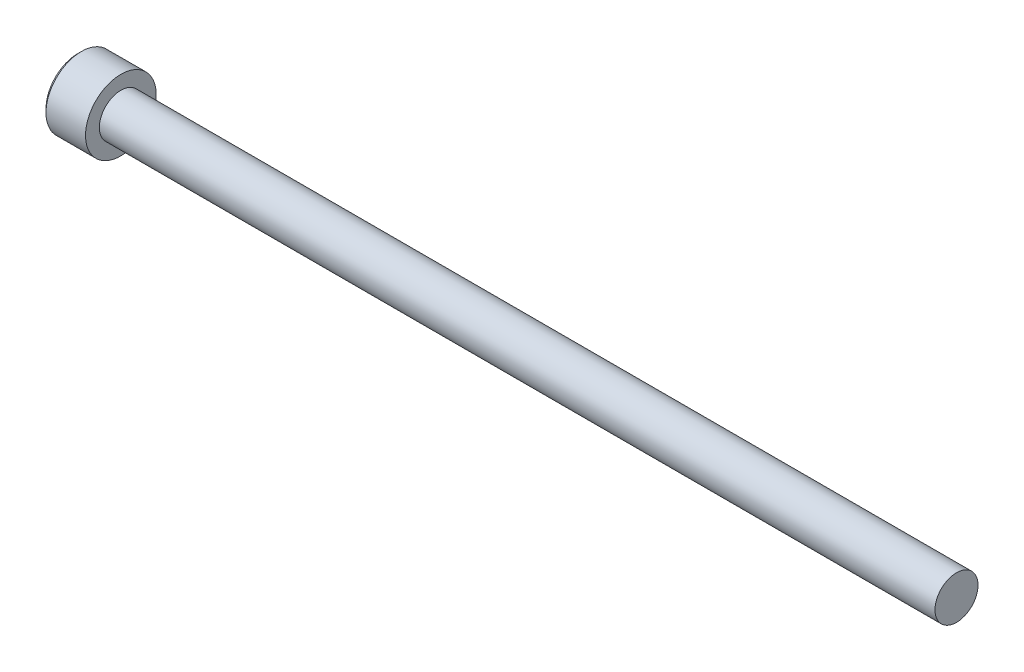
ISO-10303-21;
HEADER;
FILE_DESCRIPTION(('STEP AP214'),'2;1');
FILE_NAME('part.step','',(''),(''),'','','');
FILE_SCHEMA(('AUTOMOTIVE_DESIGN { 1 0 10303 214 1 1 1 1 }'));
ENDSEC;
DATA;
#1=APPLICATION_CONTEXT('core data for automotive mechanical design processes');
#2=APPLICATION_PROTOCOL_DEFINITION('international standard','automotive_design',2000,#1);
#3=PRODUCT_CONTEXT('',#1,'mechanical');
#4=PRODUCT('Part','Part','',(#3));
#5=PRODUCT_RELATED_PRODUCT_CATEGORY('part','',(#4));
#6=PRODUCT_DEFINITION_FORMATION('','',#4);
#7=PRODUCT_DEFINITION_CONTEXT('part definition',#1,'design');
#8=PRODUCT_DEFINITION('design','',#6,#7);
#9=PRODUCT_DEFINITION_SHAPE('','',#8);
#10=(LENGTH_UNIT() NAMED_UNIT(*) SI_UNIT(.MILLI.,.METRE.));
#11=(NAMED_UNIT(*) PLANE_ANGLE_UNIT() SI_UNIT($,.RADIAN.));
#12=(NAMED_UNIT(*) SI_UNIT($,.STERADIAN.) SOLID_ANGLE_UNIT());
#13=UNCERTAINTY_MEASURE_WITH_UNIT(LENGTH_MEASURE(1.E-05),#10,'distance_accuracy_value','');
#14=(GEOMETRIC_REPRESENTATION_CONTEXT(3) GLOBAL_UNCERTAINTY_ASSIGNED_CONTEXT((#13)) GLOBAL_UNIT_ASSIGNED_CONTEXT((#10,
#11,#12)) REPRESENTATION_CONTEXT('',''));
#15=CARTESIAN_POINT('',(0.,0.,0.));
#16=DIRECTION('',(0.,0.,1.));
#17=DIRECTION('',(1.,0.,0.));
#18=AXIS2_PLACEMENT_3D('',#15,#16,#17);
#19=CARTESIAN_POINT('',(-2.28600000000007,-1.14567944042317,1.984375));
#20=DIRECTION('',(0.,0.,1.));
#21=DIRECTION('',(1.,0.,0.));
#22=AXIS2_PLACEMENT_3D('',#19,#20,#21);
#23=PLANE('',#22);
#24=CARTESIAN_POINT('',(-4.82599999995852,1.14567944044653,1.98437499999554));
#25=CARTESIAN_POINT('',(-4.78691618362732,1.06743880343266,1.9843749999984));
#26=CARTESIAN_POINT('',(-4.75011447684892,0.987898318960917,1.98437499999957));
#27=CARTESIAN_POINT('',(-4.68265620500518,0.825677042028778,1.98437500000043));
#28=CARTESIAN_POINT('',(-4.65204056061138,0.742979382529199,1.98437500000012));
#29=CARTESIAN_POINT('',(-4.5991739228306,0.575193959555969,1.98437499999988));
#30=CARTESIAN_POINT('',(-4.57689462080725,0.490115359117279,1.98437499999997));
#31=CARTESIAN_POINT('',(-4.54259467221837,0.318093091130193,1.98437500000003));
#32=CARTESIAN_POINT('',(-4.5305423022885,0.231156054976726,1.984375));
#33=CARTESIAN_POINT('',(-4.52249110263747,0.119918521511051,1.984375));
#34=CARTESIAN_POINT('',(-4.52118947557477,0.0959468443046798,1.984375));
#35=CARTESIAN_POINT('',(-4.51945182629813,0.0479845644411998,1.984375));
#36=CARTESIAN_POINT('',(-4.51901533386223,0.0239939791589393,1.984375));
#37=CARTESIAN_POINT('',(-4.51901809008399,-0.0602201717457363,1.984375));
#38=CARTESIAN_POINT('',(-4.52177452299902,-0.120461721905447,1.984375));
#39=CARTESIAN_POINT('',(-4.5326365512493,-0.240474970989197,1.984375));
#40=CARTESIAN_POINT('',(-4.54074587749718,-0.300246312758427,1.984375));
#41=CARTESIAN_POINT('',(-4.57259622946939,-0.478763752804282,1.984375));
#42=CARTESIAN_POINT('',(-4.60385422611702,-0.596208828937734,1.984375));
#43=CARTESIAN_POINT('',(-4.66780003592237,-0.785921487441256,1.984375));
#44=CARTESIAN_POINT('',(-4.69623457768558,-0.859734609866899,1.984375));
#45=CARTESIAN_POINT('',(-4.75786140400812,-1.00456595519282,1.984375));
#46=CARTESIAN_POINT('',(-4.79100779300359,-1.07560356657101,1.984375));
#47=CARTESIAN_POINT('',(-4.82599999995643,-1.14567944044724,1.984375));
#48=B_SPLINE_CURVE_WITH_KNOTS('',3,(#24,#25,#26,#27,#28,#29,#30,#31,#32,#33,#34,#35,#36,#37,#38,
#39,#40,#41,#42,#43,#44,#45,#46,#47),.UNSPECIFIED.,.F.,.F.,(4,2,2,2,2,2,2,2,2,2,2,4),(0.,
0.262559005207405,0.526801735838036,0.790138824405318,1.05265603861765,1.12466619182083,
1.19663719499031,1.3772702672652,1.55802937209382,1.92104085090328,2.15819130092264,
2.39317265078575),.UNSPECIFIED.);
#49=CARTESIAN_POINT('',(-4.82599999996829,1.14567944041753,1.98437500003084));
#50=VERTEX_POINT('',#49);
#51=CARTESIAN_POINT('',(-4.8259999999622,-1.14567944043207,1.98437500001542));
#52=VERTEX_POINT('',#51);
#53=EDGE_CURVE('E20',#50,#52,#48,.T.);
#54=ORIENTED_EDGE('',*,*,#53,.F.);
#55=DIRECTION('',(1.,0.,0.));
#56=VECTOR('',#55,1.);
#57=CARTESIAN_POINT('',(-2.28600000000007,1.14567944042316,1.984375));
#58=LINE('',#57,#56);
#59=CARTESIAN_POINT('',(-2.28600000000007,1.14567944042316,1.984375));
#60=VERTEX_POINT('',#59);
#61=EDGE_CURVE('E68',#50,#60,#58,.T.);
#62=ORIENTED_EDGE('',*,*,#61,.T.);
#63=DIRECTION('',(0.,1.,0.));
#64=VECTOR('',#63,1.);
#65=CARTESIAN_POINT('',(-2.28600000000007,0.,1.984375));
#66=LINE('',#65,#64);
#67=CARTESIAN_POINT('',(-2.28600000000007,-1.14567944042317,1.984375));
#68=VERTEX_POINT('',#67);
#69=EDGE_CURVE('E74',#68,#60,#66,.T.);
#70=ORIENTED_EDGE('',*,*,#69,.F.);
#71=DIRECTION('',(1.,0.,0.));
#72=VECTOR('',#71,1.);
#73=CARTESIAN_POINT('',(-2.28600000000007,-1.14567944042317,1.984375));
#74=LINE('',#73,#72);
#75=EDGE_CURVE('E71',#68,#52,#74,.F.);
#76=ORIENTED_EDGE('',*,*,#75,.T.);
#77=EDGE_LOOP('',(#54,#62,#70,#76));
#78=FACE_BOUND('',#77,.T.);
#79=ADVANCED_FACE('F16',(#78),#23,.F.);
#80=CARTESIAN_POINT('',(-2.28600000000007,0.,0.));
#81=DIRECTION('',(-1.,0.,0.));
#82=DIRECTION('',(0.,0.,1.));
#83=AXIS2_PLACEMENT_3D('',#80,#81,#82);
#84=PLANE('',#83);
#85=DIRECTION('',(0.,0.5,0.866025403784439));
#86=VECTOR('',#85,1.);
#87=CARTESIAN_POINT('',(-2.28600000000007,2.29135888084633,0.));
#88=LINE('',#87,#86);
#89=CARTESIAN_POINT('',(-2.28600000000007,2.29135888084633,0.));
#90=VERTEX_POINT('',#89);
#91=CARTESIAN_POINT('',(-2.28600000000007,1.14567944042316,-1.984375));
#92=VERTEX_POINT('',#91);
#93=EDGE_CURVE('E82',#90,#92,#88,.F.);
#94=ORIENTED_EDGE('',*,*,#93,.T.);
#95=DIRECTION('',(0.,1.,0.));
#96=VECTOR('',#95,1.);
#97=CARTESIAN_POINT('',(-2.28600000000007,1.14567944042316,-1.984375));
#98=LINE('',#97,#96);
#99=CARTESIAN_POINT('',(-2.28600000000007,-1.14567944042316,-1.984375));
#100=VERTEX_POINT('',#99);
#101=EDGE_CURVE('E242',#92,#100,#98,.F.);
#102=ORIENTED_EDGE('',*,*,#101,.T.);
#103=DIRECTION('',(0.,0.5,-0.866025403784439));
#104=VECTOR('',#103,1.);
#105=CARTESIAN_POINT('',(-2.28600000000007,-1.14567944042316,-1.984375));
#106=LINE('',#105,#104);
#107=CARTESIAN_POINT('',(-2.28600000000007,-2.29135888084633,0.));
#108=VERTEX_POINT('',#107);
#109=EDGE_CURVE('E227',#100,#108,#106,.F.);
#110=ORIENTED_EDGE('',*,*,#109,.T.);
#111=DIRECTION('',(0.,-0.5,-0.866025403784439));
#112=VECTOR('',#111,1.);
#113=CARTESIAN_POINT('',(-2.28600000000007,-2.29135888084633,0.));
#114=LINE('',#113,#112);
#115=EDGE_CURVE('E224',#108,#68,#114,.F.);
#116=ORIENTED_EDGE('',*,*,#115,.T.);
#117=ORIENTED_EDGE('',*,*,#69,.T.);
#118=DIRECTION('',(0.,-0.5,0.866025403784439));
#119=VECTOR('',#118,1.);
#120=CARTESIAN_POINT('',(-2.28600000000007,1.14567944042316,1.984375));
#121=LINE('',#120,#119);
#122=EDGE_CURVE('E81',#60,#90,#121,.F.);
#123=ORIENTED_EDGE('',*,*,#122,.T.);
#124=EDGE_LOOP('',(#94,#102,#110,#116,#117,#123));
#125=FACE_BOUND('',#124,.T.);
#126=ADVANCED_FACE('F160',(#125),#84,.T.);
#127=CARTESIAN_POINT('',(-2.28600000000007,-1.14567944042316,-1.984375));
#128=DIRECTION('',(0.,-0.866025403784439,-0.5));
#129=DIRECTION('',(0.,0.5,-0.866025403784439));
#130=AXIS2_PLACEMENT_3D('',#127,#128,#129);
#131=PLANE('',#130);
#132=CARTESIAN_POINT('',(-4.82599999995871,-1.14567944040756,-1.98437500001887));
#133=CARTESIAN_POINT('',(-4.78666022792997,-1.18505700230148,-1.91617106214563));
#134=CARTESIAN_POINT('',(-4.74963132844072,-1.22509295783734,-1.8468267530301));
#135=CARTESIAN_POINT('',(-4.68183299424977,-1.30673037975396,-1.70542659047317));
#136=CARTESIAN_POINT('',(-4.65110127019237,-1.34833960561553,-1.63335729721673));
#137=CARTESIAN_POINT('',(-4.59845762010516,-1.432242568594,-1.48803310243203));
#138=CARTESIAN_POINT('',(-4.57641341195893,-1.47451494967301,-1.41481519064643));
#139=CARTESIAN_POINT('',(-4.54245011067441,-1.55999007976842,-1.26676792253773));
#140=CARTESIAN_POINT('',(-4.53050567471972,-1.6031902195197,-1.19194308559438));
#141=CARTESIAN_POINT('',(-4.51972842752365,-1.67764765054852,-1.06297903205139));
#142=CARTESIAN_POINT('',(-4.51813352794834,-1.70880881707173,-1.00900630841009));
#143=CARTESIAN_POINT('',(-4.52082392138599,-1.77108016542046,-0.901149169214274));
#144=CARTESIAN_POINT('',(-4.52511127545884,-1.80219032554946,-0.847264791239237));
#145=CARTESIAN_POINT('',(-4.53932219421538,-1.86411684097343,-0.740004920189235));
#146=CARTESIAN_POINT('',(-4.54925206045723,-1.8949328285454,-0.686630064029166));
#147=CARTESIAN_POINT('',(-4.5742029484467,-1.95603190279815,-0.580803363127978));
#148=CARTESIAN_POINT('',(-4.58922357974385,-1.98631503016081,-0.528351447923769));
#149=CARTESIAN_POINT('',(-4.63380478900425,-2.06386502548479,-0.394030915895904));
#150=CARTESIAN_POINT('',(-4.66672213384104,-2.11065153226583,-0.312994309042484));
#151=CARTESIAN_POINT('',(-4.72228952038986,-2.17944749410732,-0.193836207777459));
#152=CARTESIAN_POINT('',(-4.74181309375939,-2.20211890802843,-0.154568166986659));
#153=CARTESIAN_POINT('',(-4.78263970065987,-2.24704195201531,-0.0767591723707469));
#154=CARTESIAN_POINT('',(-4.80394164363173,-2.2692938292399,-0.0382177904539708));
#155=CARTESIAN_POINT('',(-4.82599999995675,-2.29135888085868,2.13931096265935E-11));
#156=B_SPLINE_CURVE_WITH_KNOTS('',3,(#132,#133,#134,#135,#136,#137,#138,#139,#140,#141,#142,
#143,#144,#145,#146,#147,#148,#149,#150,#151,#152,#153,#154,#155),.UNSPECIFIED.,.F.,.F.,(4,2,2,
2,2,2,2,2,2,2,2,4),(0.,0.264284909626495,0.530108996358094,0.791712695414128,1.05265800174404,
1.23942150116703,1.42625045663858,1.61328847394198,1.80031214908683,2.09727151182814,
2.24534838946042,2.39333511890876),.UNSPECIFIED.);
#157=CARTESIAN_POINT('',(-4.8259999999622,-1.14567944043207,-1.98437500001542));
#158=VERTEX_POINT('',#157);
#159=CARTESIAN_POINT('',(-4.82599999996846,-2.2913588808704,-2.00043543490866E-11));
#160=VERTEX_POINT('',#159);
#161=EDGE_CURVE('E162',#158,#160,#156,.T.);
#162=ORIENTED_EDGE('',*,*,#161,.T.);
#163=DIRECTION('',(1.,0.,0.));
#164=VECTOR('',#163,1.);
#165=CARTESIAN_POINT('',(-2.28600000000007,-2.29135888084633,0.));
#166=LINE('',#165,#164);
#167=EDGE_CURVE('E235',#160,#108,#166,.T.);
#168=ORIENTED_EDGE('',*,*,#167,.T.);
#169=ORIENTED_EDGE('',*,*,#109,.F.);
#170=DIRECTION('',(-1.,0.,0.));
#171=VECTOR('',#170,1.);
#172=CARTESIAN_POINT('',(-2.28600000000007,-1.14567944042316,-1.984375));
#173=LINE('',#172,#171);
#174=EDGE_CURVE('E245',#100,#158,#173,.T.);
#175=ORIENTED_EDGE('',*,*,#174,.T.);
#176=EDGE_LOOP('',(#162,#168,#169,#175));
#177=FACE_BOUND('',#176,.T.);
#178=ADVANCED_FACE('F156',(#177),#131,.F.);
#179=CARTESIAN_POINT('',(-2.28600000000007,-2.29135888084633,0.));
#180=DIRECTION('',(0.,-0.866025403784439,0.5));
#181=DIRECTION('',(0.,-0.5,-0.866025403784439));
#182=AXIS2_PLACEMENT_3D('',#179,#180,#181);
#183=PLANE('',#182);
#184=CARTESIAN_POINT('',(-4.8259999999587,-2.29135888085486,-2.29477011545215E-11));
#185=CARTESIAN_POINT('',(-4.78666022792997,-2.25198131896546,0.0682039378529047));
#186=CARTESIAN_POINT('',(-4.74963132844072,-2.21194536343147,0.137548246969502));
#187=CARTESIAN_POINT('',(-4.68183299424977,-2.13030794151622,0.278948409527228));
#188=CARTESIAN_POINT('',(-4.65110127019237,-2.08869871565414,0.351017702783377));
#189=CARTESIAN_POINT('',(-4.59845762010516,-2.00479575267531,0.496341897567867));
#190=CARTESIAN_POINT('',(-4.57641341195893,-1.96252337159644,0.569559809353539));
#191=CARTESIAN_POINT('',(-4.5424501106744,-1.87704824150112,0.717607077462299));
#192=CARTESIAN_POINT('',(-4.53050567471972,-1.8338481017498,0.792431914405622));
#193=CARTESIAN_POINT('',(-4.51972842752365,-1.75939067072096,0.921395967948603));
#194=CARTESIAN_POINT('',(-4.51813352794834,-1.72822950419776,0.975368691589913));
#195=CARTESIAN_POINT('',(-4.52082392138599,-1.66595815584903,1.08322583078573));
#196=CARTESIAN_POINT('',(-4.52511127545884,-1.63484799572003,1.13711020876076));
#197=CARTESIAN_POINT('',(-4.53932219421538,-1.57292148029607,1.24437007981077));
#198=CARTESIAN_POINT('',(-4.54925206045723,-1.54210549272409,1.29774493597084));
#199=CARTESIAN_POINT('',(-4.5742029484467,-1.48100641847134,1.40357163687202));
#200=CARTESIAN_POINT('',(-4.58922357974385,-1.45072329110868,1.45602355207623));
#201=CARTESIAN_POINT('',(-4.63380478900421,-1.37317329578476,1.59034408410398));
#202=CARTESIAN_POINT('',(-4.66672213384095,-1.32638678900379,1.6713806909573));
#203=CARTESIAN_POINT('',(-4.72228952038968,-1.25759082716239,1.79053879222216));
#204=CARTESIAN_POINT('',(-4.74181309375917,-1.23491941324131,1.82980683301291));
#205=CARTESIAN_POINT('',(-4.78263970065959,-1.18999636925449,1.90761582762873));
#206=CARTESIAN_POINT('',(-4.8039416436314,-1.16774449202993,1.94615720954545));
#207=CARTESIAN_POINT('',(-4.82599999995639,-1.14567944041117,1.98437500002077));
#208=B_SPLINE_CURVE_WITH_KNOTS('',3,(#184,#185,#186,#187,#188,#189,#190,#191,#192,#193,#194,
#195,#196,#197,#198,#199,#200,#201,#202,#203,#204,#205,#206,#207),.UNSPECIFIED.,.F.,.F.,(4,2,2,
2,2,2,2,2,2,2,2,4),(0.,0.264284909626493,0.530108996358089,0.791712695414125,1.05265800174404,
1.23942150116703,1.42625045663858,1.61328847394198,1.80031214908683,2.09727151182773,
2.24534838945981,2.39333511890795),.UNSPECIFIED.);
#209=EDGE_CURVE('E91',#160,#52,#208,.T.);
#210=ORIENTED_EDGE('',*,*,#209,.T.);
#211=ORIENTED_EDGE('',*,*,#75,.F.);
#212=ORIENTED_EDGE('',*,*,#115,.F.);
#213=ORIENTED_EDGE('',*,*,#167,.F.);
#214=EDGE_LOOP('',(#210,#211,#212,#213));
#215=FACE_BOUND('',#214,.T.);
#216=ADVANCED_FACE('F151',(#215),#183,.F.);
#217=CARTESIAN_POINT('',(-2.28600000000007,1.14567944042316,1.984375));
#218=DIRECTION('',(0.,0.866025403784439,0.5));
#219=DIRECTION('',(0.,-0.5,0.866025403784439));
#220=AXIS2_PLACEMENT_3D('',#217,#218,#219);
#221=PLANE('',#220);
#222=CARTESIAN_POINT('',(-4.82599999995852,1.14567944040762,1.98437500001801));
#223=CARTESIAN_POINT('',(-4.78666022792973,1.1850570023017,1.91617106214498));
#224=CARTESIAN_POINT('',(-4.74963132844047,1.22509295783761,1.84682675302957));
#225=CARTESIAN_POINT('',(-4.68183299424957,1.30673037975422,1.70542659047278));
#226=CARTESIAN_POINT('',(-4.65110127019222,1.34833960561574,1.63335729721638));
#227=CARTESIAN_POINT('',(-4.59845762010509,1.43224256859413,1.48803310243178));
#228=CARTESIAN_POINT('',(-4.57641341195888,1.47451494967311,1.41481519064625));
#229=CARTESIAN_POINT('',(-4.54245011067439,1.55999007976846,1.26676792253767));
#230=CARTESIAN_POINT('',(-4.53050567471972,1.6031902195197,1.19194308559439));
#231=CARTESIAN_POINT('',(-4.51972842752365,1.67764765054848,1.06297903205146));
#232=CARTESIAN_POINT('',(-4.51813352794835,1.70880881707169,1.00900630841016));
#233=CARTESIAN_POINT('',(-4.52082392138598,1.77108016542041,0.901149169214364));
#234=CARTESIAN_POINT('',(-4.52511127545883,1.80219032554941,0.847264791239333));
#235=CARTESIAN_POINT('',(-4.53932219421536,1.86411684097336,0.740004920189342));
#236=CARTESIAN_POINT('',(-4.54925206045721,1.89493282854533,0.686630064029278));
#237=CARTESIAN_POINT('',(-4.57420294844667,1.95603190279808,0.5808033631281));
#238=CARTESIAN_POINT('',(-4.58922357974382,1.98631503016074,0.528351447923897));
#239=CARTESIAN_POINT('',(-4.6338047890042,2.06386502548473,0.394030915896012));
#240=CARTESIAN_POINT('',(-4.666722133841,2.11065153226578,0.312994309042568));
#241=CARTESIAN_POINT('',(-4.72228952038984,2.17944749410729,0.19383620777751));
#242=CARTESIAN_POINT('',(-4.74181309375937,2.20211890802841,0.1545681669867));
#243=CARTESIAN_POINT('',(-4.78263970065986,2.24704195201529,0.0767591723707674));
#244=CARTESIAN_POINT('',(-4.80394164363172,2.26929382923989,0.0382177904539813));
#245=CARTESIAN_POINT('',(-4.82599999995675,2.29135888085868,-2.1392886942985E-11));
#246=B_SPLINE_CURVE_WITH_KNOTS('',3,(#222,#223,#224,#225,#226,#227,#228,#229,#230,#231,#232,
#233,#234,#235,#236,#237,#238,#239,#240,#241,#242,#243,#244,#245),.UNSPECIFIED.,.F.,.F.,(4,2,2,
2,2,2,2,2,2,2,2,4),(0.,0.26428490962629,0.530108996357672,0.791712695413487,1.05265800174319,
1.23942150116616,1.42625045663768,1.61328847394106,1.80031214908589,2.09727151182728,
2.2453483894596,2.39333511890798),.UNSPECIFIED.);
#247=CARTESIAN_POINT('',(-4.82599999996846,2.29135888087039,2.00042061038936E-11));
#248=VERTEX_POINT('',#247);
#249=EDGE_CURVE('E79',#50,#248,#246,.T.);
#250=ORIENTED_EDGE('',*,*,#249,.T.);
#251=DIRECTION('',(1.,0.,0.));
#252=VECTOR('',#251,1.);
#253=CARTESIAN_POINT('',(-2.28600000000007,2.29135888084633,0.));
#254=LINE('',#253,#252);
#255=EDGE_CURVE('E246',#248,#90,#254,.T.);
#256=ORIENTED_EDGE('',*,*,#255,.T.);
#257=ORIENTED_EDGE('',*,*,#122,.F.);
#258=ORIENTED_EDGE('',*,*,#61,.F.);
#259=EDGE_LOOP('',(#250,#256,#257,#258));
#260=FACE_BOUND('',#259,.T.);
#261=ADVANCED_FACE('F76',(#260),#221,.F.);
#262=CARTESIAN_POINT('',(-2.28600000000007,2.29135888084633,0.));
#263=DIRECTION('',(0.,0.866025403784439,-0.5));
#264=DIRECTION('',(0.,0.5,0.866025403784439));
#265=AXIS2_PLACEMENT_3D('',#262,#263,#264);
#266=PLANE('',#265);
#267=CARTESIAN_POINT('',(-4.82599999995871,2.29135888085486,2.29489280696874E-11));
#268=CARTESIAN_POINT('',(-4.78666022792997,2.25198131896547,-0.0682039378529039));
#269=CARTESIAN_POINT('',(-4.74963132844072,2.21194536343147,-0.137548246969502));
#270=CARTESIAN_POINT('',(-4.68183299424977,2.13030794151622,-0.278948409527229));
#271=CARTESIAN_POINT('',(-4.65110127019237,2.08869871565414,-0.351017702783379));
#272=CARTESIAN_POINT('',(-4.59845762010516,2.00479575267531,-0.496341897567869));
#273=CARTESIAN_POINT('',(-4.57641341195893,1.96252337159644,-0.569559809353541));
#274=CARTESIAN_POINT('',(-4.5424501106744,1.87704824150112,-0.7176070774623));
#275=CARTESIAN_POINT('',(-4.53050567471972,1.8338481017498,-0.792431914405622));
#276=CARTESIAN_POINT('',(-4.51972842752365,1.75939067072096,-0.921395967948603));
#277=CARTESIAN_POINT('',(-4.51813352794834,1.72822950419776,-0.975368691589912));
#278=CARTESIAN_POINT('',(-4.52082392138599,1.66595815584903,-1.08322583078573));
#279=CARTESIAN_POINT('',(-4.52511127545884,1.63484799572003,-1.13711020876076));
#280=CARTESIAN_POINT('',(-4.53932219421538,1.57292148029607,-1.24437007981077));
#281=CARTESIAN_POINT('',(-4.54925206045723,1.54210549272409,-1.29774493597083));
#282=CARTESIAN_POINT('',(-4.5742029484467,1.48100641847134,-1.40357163687202));
#283=CARTESIAN_POINT('',(-4.58922357974385,1.45072329110868,-1.45602355207623));
#284=CARTESIAN_POINT('',(-4.63380478900425,1.3731732957847,-1.5903440841041));
#285=CARTESIAN_POINT('',(-4.66672213384104,1.32638678900366,-1.67138069095752));
#286=CARTESIAN_POINT('',(-4.72228952038986,1.25759082716218,-1.79053879222254));
#287=CARTESIAN_POINT('',(-4.74181309375939,1.23491941324106,-1.82980683301334));
#288=CARTESIAN_POINT('',(-4.78263970065987,1.18999636925419,-1.90761582762925));
#289=CARTESIAN_POINT('',(-4.80394164363173,1.1677444920296,-1.94615720954603));
#290=CARTESIAN_POINT('',(-4.82599999995675,1.14567944041081,-1.98437500002139));
#291=B_SPLINE_CURVE_WITH_KNOTS('',3,(#267,#268,#269,#270,#271,#272,#273,#274,#275,#276,#277,
#278,#279,#280,#281,#282,#283,#284,#285,#286,#287,#288,#289,#290),.UNSPECIFIED.,.F.,.F.,(4,2,2,
2,2,2,2,2,2,2,2,4),(0.,0.264284909626495,0.530108996358093,0.791712695414127,1.05265800174404,
1.23942150116703,1.42625045663858,1.61328847394198,1.80031214908683,2.09727151182814,
2.24534838946042,2.39333511890876),.UNSPECIFIED.);
#292=CARTESIAN_POINT('',(-4.82599999996846,1.14567944045252,-1.98437500001084));
#293=VERTEX_POINT('',#292);
#294=EDGE_CURVE('E39',#248,#293,#291,.T.);
#295=ORIENTED_EDGE('',*,*,#294,.T.);
#296=DIRECTION('',(-1.,0.,0.));
#297=VECTOR('',#296,1.);
#298=CARTESIAN_POINT('',(-2.28600000000007,1.14567944042316,-1.984375));
#299=LINE('',#298,#297);
#300=EDGE_CURVE('E166',#293,#92,#299,.F.);
#301=ORIENTED_EDGE('',*,*,#300,.T.);
#302=ORIENTED_EDGE('',*,*,#93,.F.);
#303=ORIENTED_EDGE('',*,*,#255,.F.);
#304=EDGE_LOOP('',(#295,#301,#302,#303));
#305=FACE_BOUND('',#304,.T.);
#306=ADVANCED_FACE('F150',(#305),#266,.F.);
#307=CARTESIAN_POINT('',(-2.28600000000007,1.14567944042316,-1.984375));
#308=DIRECTION('',(0.,0.,-1.));
#309=DIRECTION('',(-1.,0.,0.));
#310=AXIS2_PLACEMENT_3D('',#307,#308,#309);
#311=PLANE('',#310);
#312=CARTESIAN_POINT('',(-4.8259999999587,1.14567944044731,-1.98437499999592));
#313=CARTESIAN_POINT('',(-4.78666022793094,1.06692431665146,-1.98437499999853));
#314=CARTESIAN_POINT('',(-4.74963132844318,0.986852405569011,-1.98437499999961));
#315=CARTESIAN_POINT('',(-4.6818329942566,0.823577561711963,-1.9843750000004));
#316=CARTESIAN_POINT('',(-4.65110127020207,0.740359109975722,-1.98437500000011));
#317=CARTESIAN_POINT('',(-4.59845762012233,0.572553183993917,-1.9843749999999));
#318=CARTESIAN_POINT('',(-4.57641341198063,0.488008421824127,-1.98437499999997));
#319=CARTESIAN_POINT('',(-4.54245011070673,0.317058161610178,-1.98437500000003));
#320=CARTESIAN_POINT('',(-4.53050567475816,0.230657882096267,-1.98437500000001));
#321=CARTESIAN_POINT('',(-4.51972842757294,0.0817430200124032,-1.984375));
#322=CARTESIAN_POINT('',(-4.51813352800283,0.0194206869508218,-1.984375));
#323=CARTESIAN_POINT('',(-4.52082392145254,-0.1051220097764,-1.984375));
#324=CARTESIAN_POINT('',(-4.52511127553227,-0.167342330049008,-1.984375));
#325=CARTESIAN_POINT('',(-4.53932219430377,-0.291195360925477,-1.984375));
#326=CARTESIAN_POINT('',(-4.54925206055372,-0.352827336083362,-1.984375));
#327=CARTESIAN_POINT('',(-4.57420294856008,-0.475025484616114,-1.984375));
#328=CARTESIAN_POINT('',(-4.58922357986604,-0.535591739354747,-1.984375));
#329=CARTESIAN_POINT('',(-4.63380478912724,-0.690691729958653,-1.984375));
#330=CARTESIAN_POINT('',(-4.66672213394715,-0.784264743465576,-1.984375));
#331=CARTESIAN_POINT('',(-4.7222895204619,-0.921856667069616,-1.984375));
#332=CARTESIAN_POINT('',(-4.74181309381856,-0.967199494886089,-1.984375));
#333=CARTESIAN_POINT('',(-4.78263970069104,-1.05704558280959,-1.984375));
#334=CARTESIAN_POINT('',(-4.80394164364776,-1.10154933723428,-1.984375));
#335=CARTESIAN_POINT('',(-4.82599999995675,-1.14567944044787,-1.984375));
#336=B_SPLINE_CURVE_WITH_KNOTS('',3,(#312,#313,#314,#315,#316,#317,#318,#319,#320,#321,#322,
#323,#324,#325,#326,#327,#328,#329,#330,#331,#332,#333,#334,#335),.UNSPECIFIED.,.F.,.F.,(4,2,2,
2,2,2,2,2,2,2,2,4),(0.,0.264284909658836,0.530108996422784,0.791712695509868,1.0526580018708,
1.23942150133878,1.42625045685537,1.61328847420389,1.80031214939384,2.09727151196384,
2.24534838950992,2.39333511887245),.UNSPECIFIED.);
#337=EDGE_CURVE('E108',#293,#158,#336,.T.);
#338=ORIENTED_EDGE('',*,*,#337,.T.);
#339=ORIENTED_EDGE('',*,*,#174,.F.);
#340=ORIENTED_EDGE('',*,*,#101,.F.);
#341=ORIENTED_EDGE('',*,*,#300,.F.);
#342=EDGE_LOOP('',(#338,#339,#340,#341));
#343=FACE_BOUND('',#342,.T.);
#344=ADVANCED_FACE('F121',(#343),#311,.F.);
#345=CARTESIAN_POINT('',(-4.82599999998001,0.,0.));
#346=DIRECTION('',(-1.,0.,0.));
#347=DIRECTION('',(0.,0.,1.));
#348=AXIS2_PLACEMENT_3D('',#345,#346,#347);
#349=CONICAL_SURFACE('',#348,2.29135888088194,0.785398163397448);
#350=ORIENTED_EDGE('',*,*,#161,.F.);
#351=CARTESIAN_POINT('',(-4.82599999998001,0.,0.));
#352=DIRECTION('',(-1.,0.,0.));
#353=DIRECTION('',(0.,0.,1.));
#354=AXIS2_PLACEMENT_3D('',#351,#352,#353);
#355=CIRCLE('',#354,2.29135888088194);
#356=EDGE_CURVE('E105',#158,#160,#355,.T.);
#357=ORIENTED_EDGE('',*,*,#356,.T.);
#358=EDGE_LOOP('',(#350,#357));
#359=FACE_BOUND('',#358,.T.);
#360=ADVANCED_FACE('F167',(#359),#349,.F.);
#361=CARTESIAN_POINT('',(-4.82599999998001,0.,0.));
#362=DIRECTION('',(-1.,0.,0.));
#363=DIRECTION('',(0.,0.,1.));
#364=AXIS2_PLACEMENT_3D('',#361,#362,#363);
#365=CONICAL_SURFACE('',#364,2.29135888088194,0.785398163397448);
#366=ORIENTED_EDGE('',*,*,#209,.F.);
#367=CARTESIAN_POINT('',(-4.82599999998001,0.,0.));
#368=DIRECTION('',(-1.,0.,0.));
#369=DIRECTION('',(0.,0.,1.));
#370=AXIS2_PLACEMENT_3D('',#367,#368,#369);
#371=CIRCLE('',#370,2.29135888088194);
#372=EDGE_CURVE('E86',#160,#52,#371,.T.);
#373=ORIENTED_EDGE('',*,*,#372,.T.);
#374=EDGE_LOOP('',(#366,#373));
#375=FACE_BOUND('',#374,.T.);
#376=ADVANCED_FACE('F170',(#375),#365,.F.);
#377=CARTESIAN_POINT('',(-4.82599999998001,0.,0.));
#378=DIRECTION('',(-1.,0.,0.));
#379=DIRECTION('',(0.,0.,1.));
#380=AXIS2_PLACEMENT_3D('',#377,#378,#379);
#381=CONICAL_SURFACE('',#380,2.29135888088194,0.78539816348948);
#382=CARTESIAN_POINT('',(-4.82599999998001,0.,0.));
#383=DIRECTION('',(-1.,0.,0.));
#384=DIRECTION('',(0.,0.,1.));
#385=AXIS2_PLACEMENT_3D('',#382,#383,#384);
#386=CIRCLE('',#385,2.29135888088194);
#387=EDGE_CURVE('E59',#52,#50,#386,.T.);
#388=ORIENTED_EDGE('',*,*,#387,.T.);
#389=ORIENTED_EDGE('',*,*,#53,.T.);
#390=EDGE_LOOP('',(#388,#389));
#391=FACE_BOUND('',#390,.T.);
#392=ADVANCED_FACE('F84',(#391),#381,.F.);
#393=CARTESIAN_POINT('',(-4.82599999998001,0.,0.));
#394=DIRECTION('',(-1.,0.,0.));
#395=DIRECTION('',(0.,0.,1.));
#396=AXIS2_PLACEMENT_3D('',#393,#394,#395);
#397=CONICAL_SURFACE('',#396,2.29135888088194,0.785398163397448);
#398=ORIENTED_EDGE('',*,*,#249,.F.);
#399=CARTESIAN_POINT('',(-4.82599999998001,0.,0.));
#400=DIRECTION('',(-1.,0.,0.));
#401=DIRECTION('',(0.,0.,1.));
#402=AXIS2_PLACEMENT_3D('',#399,#400,#401);
#403=CIRCLE('',#402,2.29135888088194);
#404=EDGE_CURVE('E85',#50,#248,#403,.T.);
#405=ORIENTED_EDGE('',*,*,#404,.T.);
#406=EDGE_LOOP('',(#398,#405));
#407=FACE_BOUND('',#406,.T.);
#408=ADVANCED_FACE('F90',(#407),#397,.F.);
#409=CARTESIAN_POINT('',(-4.82599999998001,0.,0.));
#410=DIRECTION('',(-1.,0.,0.));
#411=DIRECTION('',(0.,0.,1.));
#412=AXIS2_PLACEMENT_3D('',#409,#410,#411);
#413=CONICAL_SURFACE('',#412,2.29135888088194,0.785398163397448);
#414=ORIENTED_EDGE('',*,*,#294,.F.);
#415=CARTESIAN_POINT('',(-4.82599999998001,0.,0.));
#416=DIRECTION('',(-1.,0.,0.));
#417=DIRECTION('',(0.,0.,1.));
#418=AXIS2_PLACEMENT_3D('',#415,#416,#417);
#419=CIRCLE('',#418,2.29135888088194);
#420=EDGE_CURVE('E97',#248,#293,#419,.T.);
#421=ORIENTED_EDGE('',*,*,#420,.T.);
#422=EDGE_LOOP('',(#414,#421));
#423=FACE_BOUND('',#422,.T.);
#424=ADVANCED_FACE('F128',(#423),#413,.F.);
#425=CARTESIAN_POINT('',(-4.82599999998001,0.,0.));
#426=DIRECTION('',(-1.,0.,0.));
#427=DIRECTION('',(0.,0.,1.));
#428=AXIS2_PLACEMENT_3D('',#425,#426,#427);
#429=CONICAL_SURFACE('',#428,2.29135888088194,0.785398163489476);
#430=ORIENTED_EDGE('',*,*,#337,.F.);
#431=CARTESIAN_POINT('',(-4.82599999998001,0.,0.));
#432=DIRECTION('',(-1.,0.,0.));
#433=DIRECTION('',(0.,0.,1.));
#434=AXIS2_PLACEMENT_3D('',#431,#432,#433);
#435=CIRCLE('',#434,2.29135888088194);
#436=EDGE_CURVE('E99',#293,#158,#435,.T.);
#437=ORIENTED_EDGE('',*,*,#436,.T.);
#438=EDGE_LOOP('',(#430,#437));
#439=FACE_BOUND('',#438,.T.);
#440=ADVANCED_FACE('F124',(#439),#429,.F.);
#441=CARTESIAN_POINT('',(-4.82600000000007,0.,0.));
#442=DIRECTION('',(1.,0.,0.));
#443=DIRECTION('',(0.,0.,-1.));
#444=AXIS2_PLACEMENT_3D('',#441,#442,#443);
#445=PLANE('',#444);
#446=CARTESIAN_POINT('',(-4.82599999998001,0.,0.));
#447=DIRECTION('',(1.,0.,0.));
#448=DIRECTION('',(0.,0.,-1.));
#449=AXIS2_PLACEMENT_3D('',#446,#447,#448);
#450=CIRCLE('',#449,3.56615999999121);
#451=CARTESIAN_POINT('',(-4.82599999998001,0.,-3.56615999999121));
#452=VERTEX_POINT('',#451);
#453=EDGE_CURVE('E212',#452,#452,#450,.T.);
#454=ORIENTED_EDGE('',*,*,#453,.F.);
#455=EDGE_LOOP('',(#454));
#456=FACE_BOUND('',#455,.T.);
#457=ORIENTED_EDGE('',*,*,#420,.F.);
#458=ORIENTED_EDGE('',*,*,#404,.F.);
#459=ORIENTED_EDGE('',*,*,#387,.F.);
#460=ORIENTED_EDGE('',*,*,#372,.F.);
#461=ORIENTED_EDGE('',*,*,#356,.F.);
#462=ORIENTED_EDGE('',*,*,#436,.F.);
#463=EDGE_LOOP('',(#457,#458,#459,#460,#461,#462));
#464=FACE_BOUND('',#463,.T.);
#465=ADVANCED_FACE('F94',(#456,#464),#445,.F.);
#466=CARTESIAN_POINT('',(-4.42976000010731,0.,0.));
#467=DIRECTION('',(1.,0.,0.));
#468=DIRECTION('',(0.,0.,-1.));
#469=AXIS2_PLACEMENT_3D('',#466,#467,#468);
#470=CONICAL_SURFACE('',#469,3.96239999986392,0.785398163397448);
#471=CARTESIAN_POINT('',(-4.42976000000007,0.,0.));
#472=DIRECTION('',(-1.,0.,0.));
#473=DIRECTION('',(0.,0.,1.));
#474=AXIS2_PLACEMENT_3D('',#471,#472,#473);
#475=CIRCLE('',#474,3.9624);
#476=CARTESIAN_POINT('',(-4.42976000000007,0.,3.9624));
#477=VERTEX_POINT('',#476);
#478=EDGE_CURVE('E209',#477,#477,#475,.F.);
#479=ORIENTED_EDGE('',*,*,#478,.F.);
#480=EDGE_LOOP('',(#479));
#481=FACE_BOUND('',#480,.T.);
#482=ORIENTED_EDGE('',*,*,#453,.T.);
#483=EDGE_LOOP('',(#482));
#484=FACE_BOUND('',#483,.T.);
#485=ADVANCED_FACE('F198',(#481,#484),#470,.T.);
#486=CARTESIAN_POINT('',(-4.82600000000008,0.,0.));
#487=DIRECTION('',(-1.,0.,0.));
#488=DIRECTION('',(0.,0.,1.));
#489=AXIS2_PLACEMENT_3D('',#486,#487,#488);
#490=CYLINDRICAL_SURFACE('',#489,3.9624);
#491=ORIENTED_EDGE('',*,*,#478,.T.);
#492=EDGE_LOOP('',(#491));
#493=FACE_BOUND('',#492,.T.);
#494=CARTESIAN_POINT('',(0.,0.,0.));
#495=DIRECTION('',(-1.,0.,0.));
#496=DIRECTION('',(0.,0.,1.));
#497=AXIS2_PLACEMENT_3D('',#494,#495,#496);
#498=CIRCLE('',#497,3.9624);
#499=CARTESIAN_POINT('',(0.,0.,3.9624));
#500=VERTEX_POINT('',#499);
#501=EDGE_CURVE('E214',#500,#500,#498,.T.);
#502=ORIENTED_EDGE('',*,*,#501,.T.);
#503=EDGE_LOOP('',(#502));
#504=FACE_BOUND('',#503,.T.);
#505=ADVANCED_FACE('F195',(#493,#504),#490,.T.);
#506=CARTESIAN_POINT('',(93.6625,0.,0.));
#507=DIRECTION('',(1.,0.,0.));
#508=DIRECTION('',(0.,0.,-1.));
#509=AXIS2_PLACEMENT_3D('',#506,#507,#508);
#510=PLANE('',#509);
#511=CARTESIAN_POINT('',(93.6625,0.,0.));
#512=DIRECTION('',(-1.,0.,0.));
#513=DIRECTION('',(0.,0.,1.));
#514=AXIS2_PLACEMENT_3D('',#511,#512,#513);
#515=CIRCLE('',#514,2.413);
#516=CARTESIAN_POINT('',(93.6625,0.,2.413));
#517=VERTEX_POINT('',#516);
#518=EDGE_CURVE('E30',#517,#517,#515,.T.);
#519=ORIENTED_EDGE('',*,*,#518,.F.);
#520=EDGE_LOOP('',(#519));
#521=FACE_BOUND('',#520,.T.);
#522=ADVANCED_FACE('F188',(#521),#510,.T.);
#523=CARTESIAN_POINT('',(0.,3.9624,0.));
#524=DIRECTION('',(-1.,0.,0.));
#525=DIRECTION('',(0.,0.,1.));
#526=AXIS2_PLACEMENT_3D('',#523,#524,#525);
#527=PLANE('',#526);
#528=CARTESIAN_POINT('',(0.,0.,0.));
#529=DIRECTION('',(-1.,0.,0.));
#530=DIRECTION('',(0.,0.,1.));
#531=AXIS2_PLACEMENT_3D('',#528,#529,#530);
#532=CIRCLE('',#531,2.413);
#533=CARTESIAN_POINT('',(0.,0.,2.413));
#534=VERTEX_POINT('',#533);
#535=EDGE_CURVE('E11',#534,#534,#532,.F.);
#536=ORIENTED_EDGE('',*,*,#535,.F.);
#537=EDGE_LOOP('',(#536));
#538=FACE_BOUND('',#537,.T.);
#539=ORIENTED_EDGE('',*,*,#501,.F.);
#540=EDGE_LOOP('',(#539));
#541=FACE_BOUND('',#540,.T.);
#542=ADVANCED_FACE('F182',(#538,#541),#527,.F.);
#543=CARTESIAN_POINT('',(93.6625,0.,0.));
#544=DIRECTION('',(-1.,0.,0.));
#545=DIRECTION('',(0.,0.,1.));
#546=AXIS2_PLACEMENT_3D('',#543,#544,#545);
#547=CYLINDRICAL_SURFACE('',#546,2.413);
#548=ORIENTED_EDGE('',*,*,#535,.T.);
#549=EDGE_LOOP('',(#548));
#550=FACE_BOUND('',#549,.T.);
#551=ORIENTED_EDGE('',*,*,#518,.T.);
#552=EDGE_LOOP('',(#551));
#553=FACE_BOUND('',#552,.T.);
#554=ADVANCED_FACE('F180',(#550,#553),#547,.T.);
#555=CLOSED_SHELL('',(#79,#126,#178,#216,#261,#306,#344,#360,#376,#392,#408,#424,#440,#465,#485,
#505,#522,#542,#554));
#556=MANIFOLD_SOLID_BREP('B1',#555);
#557=ADVANCED_BREP_SHAPE_REPRESENTATION('',(#18,#556),#14);
#558=SHAPE_DEFINITION_REPRESENTATION(#9,#557);
ENDSEC;
END-ISO-10303-21;
